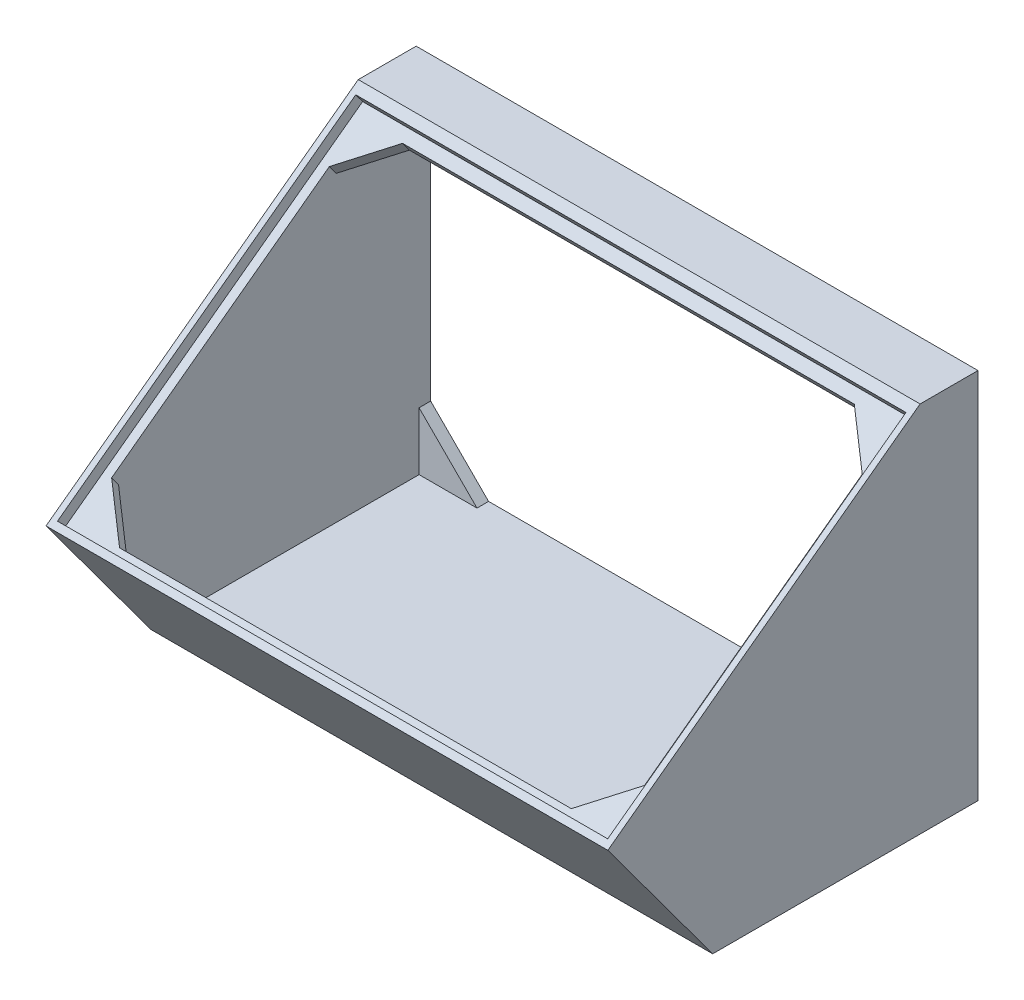
ISO-10303-21;
HEADER;
FILE_DESCRIPTION(('STEP AP214'),'2;1');
FILE_NAME('part.step','',(''),(''),'','','');
FILE_SCHEMA(('AUTOMOTIVE_DESIGN { 1 0 10303 214 1 1 1 1 }'));
ENDSEC;
DATA;
#1=APPLICATION_CONTEXT('core data for automotive mechanical design processes');
#2=APPLICATION_PROTOCOL_DEFINITION('international standard','automotive_design',2000,#1);
#3=PRODUCT_CONTEXT('',#1,'mechanical');
#4=PRODUCT('Part','Part','',(#3));
#5=PRODUCT_RELATED_PRODUCT_CATEGORY('part','',(#4));
#6=PRODUCT_DEFINITION_FORMATION('','',#4);
#7=PRODUCT_DEFINITION_CONTEXT('part definition',#1,'design');
#8=PRODUCT_DEFINITION('design','',#6,#7);
#9=PRODUCT_DEFINITION_SHAPE('','',#8);
#10=(LENGTH_UNIT() NAMED_UNIT(*) SI_UNIT(.MILLI.,.METRE.));
#11=(NAMED_UNIT(*) PLANE_ANGLE_UNIT() SI_UNIT($,.RADIAN.));
#12=(NAMED_UNIT(*) SI_UNIT($,.STERADIAN.) SOLID_ANGLE_UNIT());
#13=UNCERTAINTY_MEASURE_WITH_UNIT(LENGTH_MEASURE(1.E-05),#10,'distance_accuracy_value','');
#14=(GEOMETRIC_REPRESENTATION_CONTEXT(3) GLOBAL_UNCERTAINTY_ASSIGNED_CONTEXT((#13)) GLOBAL_UNIT_ASSIGNED_CONTEXT((#10,
#11,#12)) REPRESENTATION_CONTEXT('',''));
#15=CARTESIAN_POINT('',(0.,0.,0.));
#16=DIRECTION('',(0.,0.,1.));
#17=DIRECTION('',(1.,0.,0.));
#18=AXIS2_PLACEMENT_3D('',#15,#16,#17);
#19=CARTESIAN_POINT('',(97.,38.9166666666667,0.));
#20=DIRECTION('',(0.,-1.,0.));
#21=DIRECTION('',(0.,0.,-1.));
#22=AXIS2_PLACEMENT_3D('',#19,#20,#21);
#23=PLANE('',#22);
#24=DIRECTION('',(0.,0.,-1.));
#25=VECTOR('',#24,1.);
#26=CARTESIAN_POINT('',(12.5,38.9166666666667,2.));
#27=LINE('',#26,#25);
#28=CARTESIAN_POINT('',(12.5,38.9166666666667,2.));
#29=VERTEX_POINT('',#28);
#30=CARTESIAN_POINT('',(12.5,38.9166666666667,0.));
#31=VERTEX_POINT('',#30);
#32=EDGE_CURVE('E436',#29,#31,#27,.T.);
#33=ORIENTED_EDGE('',*,*,#32,.T.);
#34=DIRECTION('',(-1.,0.,0.));
#35=VECTOR('',#34,1.);
#36=CARTESIAN_POINT('',(97.,38.9166666666667,0.));
#37=LINE('',#36,#35);
#38=CARTESIAN_POINT('',(84.5,38.9166666666667,0.));
#39=VERTEX_POINT('',#38);
#40=EDGE_CURVE('E281',#39,#31,#37,.T.);
#41=ORIENTED_EDGE('',*,*,#40,.F.);
#42=DIRECTION('',(0.,0.,-1.));
#43=VECTOR('',#42,1.);
#44=CARTESIAN_POINT('',(84.5,38.9166666666667,2.));
#45=LINE('',#44,#43);
#46=CARTESIAN_POINT('',(84.5,38.9166666666667,2.));
#47=VERTEX_POINT('',#46);
#48=EDGE_CURVE('E463',#47,#39,#45,.T.);
#49=ORIENTED_EDGE('',*,*,#48,.F.);
#50=DIRECTION('',(1.,0.,0.));
#51=VECTOR('',#50,1.);
#52=CARTESIAN_POINT('',(94.5,38.9166666666667,2.));
#53=LINE('',#52,#51);
#54=CARTESIAN_POINT('',(94.5,38.9166666666667,2.));
#55=VERTEX_POINT('',#54);
#56=EDGE_CURVE('E447',#47,#55,#53,.T.);
#57=ORIENTED_EDGE('',*,*,#56,.T.);
#58=DIRECTION('',(0.,0.,1.));
#59=VECTOR('',#58,1.);
#60=CARTESIAN_POINT('',(94.5,38.9166666666667,0.));
#61=LINE('',#60,#59);
#62=CARTESIAN_POINT('',(94.5,38.9166666666667,6.65116187016871));
#63=VERTEX_POINT('',#62);
#64=EDGE_CURVE('E263',#55,#63,#61,.T.);
#65=ORIENTED_EDGE('',*,*,#64,.T.);
#66=DIRECTION('',(1.,0.,0.));
#67=VECTOR('',#66,1.);
#68=CARTESIAN_POINT('',(1.49999999999997,38.9166666666667,6.65116187016871));
#69=LINE('',#68,#67);
#70=CARTESIAN_POINT('',(2.5,38.9166666666667,6.65116187016871));
#71=VERTEX_POINT('',#70);
#72=EDGE_CURVE('E496',#71,#63,#69,.T.);
#73=ORIENTED_EDGE('',*,*,#72,.F.);
#74=DIRECTION('',(0.,0.,1.));
#75=VECTOR('',#74,1.);
#76=CARTESIAN_POINT('',(2.5,38.9166666666667,0.));
#77=LINE('',#76,#75);
#78=CARTESIAN_POINT('',(2.5,38.9166666666667,2.));
#79=VERTEX_POINT('',#78);
#80=EDGE_CURVE('E277',#79,#71,#77,.T.);
#81=ORIENTED_EDGE('',*,*,#80,.F.);
#82=DIRECTION('',(1.,0.,0.));
#83=VECTOR('',#82,1.);
#84=CARTESIAN_POINT('',(12.5,38.9166666666667,2.));
#85=LINE('',#84,#83);
#86=EDGE_CURVE('E426',#79,#29,#85,.T.);
#87=ORIENTED_EDGE('',*,*,#86,.T.);
#88=EDGE_LOOP('',(#33,#41,#49,#57,#65,#73,#81,#87));
#89=FACE_BOUND('',#88,.T.);
#90=ADVANCED_FACE('F39',(#89),#23,.T.);
#91=CARTESIAN_POINT('',(94.5,0.,0.));
#92=DIRECTION('',(1.,0.,0.));
#93=DIRECTION('',(0.,0.,-1.));
#94=AXIS2_PLACEMENT_3D('',#91,#92,#93);
#95=PLANE('',#94);
#96=DIRECTION('',(0.,-0.593752276825451,0.804647894277114));
#97=VECTOR('',#96,1.);
#98=CARTESIAN_POINT('',(94.5,29.9838812525611,22.1252026984624));
#99=LINE('',#98,#97);
#100=CARTESIAN_POINT('',(94.5,33.4060518320674,17.4875070497326));
#101=VERTEX_POINT('',#100);
#102=CARTESIAN_POINT('',(94.5,5.66661496064908,55.0797493672832));
#103=VERTEX_POINT('',#102);
#104=EDGE_CURVE('E62',#101,#103,#99,.T.);
#105=ORIENTED_EDGE('',*,*,#104,.F.);
#106=DIRECTION('',(0.,0.804647894277114,0.593752276825451));
#107=VECTOR('',#106,1.);
#108=CARTESIAN_POINT('',(94.5,31.7967560435132,16.3000024960817));
#109=LINE('',#108,#107);
#110=CARTESIAN_POINT('',(94.5,31.7967560435132,16.3000024960817));
#111=VERTEX_POINT('',#110);
#112=EDGE_CURVE('E560',#111,#101,#109,.T.);
#113=ORIENTED_EDGE('',*,*,#112,.F.);
#114=DIRECTION('',(0.,-0.593752276825452,0.804647894277113));
#115=VECTOR('',#114,1.);
#116=CARTESIAN_POINT('',(94.5,35.9530219812913,10.6674672361419));
#117=LINE('',#116,#115);
#118=EDGE_CURVE('E55',#63,#111,#117,.T.);
#119=ORIENTED_EDGE('',*,*,#118,.F.);
#120=ORIENTED_EDGE('',*,*,#64,.F.);
#121=DIRECTION('',(0.,-1.,0.));
#122=VECTOR('',#121,1.);
#123=CARTESIAN_POINT('',(94.5,28.9166666666667,2.));
#124=LINE('',#123,#122);
#125=CARTESIAN_POINT('',(94.5,28.9166666666667,2.));
#126=VERTEX_POINT('',#125);
#127=EDGE_CURVE('E451',#55,#126,#124,.T.);
#128=ORIENTED_EDGE('',*,*,#127,.T.);
#129=DIRECTION('',(0.,0.,-1.));
#130=VECTOR('',#129,1.);
#131=CARTESIAN_POINT('',(94.5,28.9166666666667,2.));
#132=LINE('',#131,#130);
#133=CARTESIAN_POINT('',(94.5,28.9166666666667,0.));
#134=VERTEX_POINT('',#133);
#135=EDGE_CURVE('E459',#126,#134,#132,.T.);
#136=ORIENTED_EDGE('',*,*,#135,.T.);
#137=DIRECTION('',(0.,1.,0.));
#138=VECTOR('',#137,1.);
#139=CARTESIAN_POINT('',(94.5,-22.9015754372374,0.));
#140=LINE('',#139,#138);
#141=CARTESIAN_POINT('',(94.5,-10.4015754372374,0.));
#142=VERTEX_POINT('',#141);
#143=EDGE_CURVE('E269',#142,#134,#140,.T.);
#144=ORIENTED_EDGE('',*,*,#143,.F.);
#145=DIRECTION('',(0.,0.,-1.));
#146=VECTOR('',#145,1.);
#147=CARTESIAN_POINT('',(94.5,-10.4015754372374,2.));
#148=LINE('',#147,#146);
#149=CARTESIAN_POINT('',(94.5,-10.4015754372374,2.));
#150=VERTEX_POINT('',#149);
#151=EDGE_CURVE('E484',#150,#142,#148,.T.);
#152=ORIENTED_EDGE('',*,*,#151,.F.);
#153=DIRECTION('',(0.,-1.,0.));
#154=VECTOR('',#153,1.);
#155=CARTESIAN_POINT('',(94.5,-20.4015754372374,2.));
#156=LINE('',#155,#154);
#157=CARTESIAN_POINT('',(94.5,-20.4015754372374,2.));
#158=VERTEX_POINT('',#157);
#159=EDGE_CURVE('E470',#150,#158,#156,.T.);
#160=ORIENTED_EDGE('',*,*,#159,.T.);
#161=DIRECTION('',(0.,0.,-1.));
#162=VECTOR('',#161,1.);
#163=CARTESIAN_POINT('',(94.5,-20.4015754372374,45.8055958566569));
#164=LINE('',#163,#162);
#165=CARTESIAN_POINT('',(94.5,-20.4015754372374,44.5434048844817));
#166=VERTEX_POINT('',#165);
#167=EDGE_CURVE('E261',#166,#158,#164,.T.);
#168=ORIENTED_EDGE('',*,*,#167,.F.);
#169=DIRECTION('',(0.,-0.804647894277114,-0.593752276825451));
#170=VECTOR('',#169,1.);
#171=CARTESIAN_POINT('',(94.5,3.11964481142516,61.8997891808738));
#172=LINE('',#171,#170);
#173=CARTESIAN_POINT('',(94.5,-0.0989467656832992,59.5247800735721));
#174=VERTEX_POINT('',#173);
#175=EDGE_CURVE('E251',#174,#166,#172,.T.);
#176=ORIENTED_EDGE('',*,*,#175,.F.);
#177=DIRECTION('',(0.,0.593752276825451,-0.804647894277114));
#178=VECTOR('',#177,1.);
#179=CARTESIAN_POINT('',(94.5,-0.0989467656832992,59.5247800735721));
#180=LINE('',#179,#178);
#181=CARTESIAN_POINT('',(94.5,4.05731917209486,53.8922448136323));
#182=VERTEX_POINT('',#181);
#183=EDGE_CURVE('E238',#174,#182,#180,.T.);
#184=ORIENTED_EDGE('',*,*,#183,.T.);
#185=DIRECTION('',(0.,0.804647894277114,0.593752276825451));
#186=VECTOR('',#185,1.);
#187=CARTESIAN_POINT('',(94.5,4.05731917209486,53.8922448136323));
#188=LINE('',#187,#186);
#189=EDGE_CURVE('E385',#182,#103,#188,.T.);
#190=ORIENTED_EDGE('',*,*,#189,.T.);
#191=EDGE_LOOP('',(#105,#113,#119,#120,#128,#136,#144,#152,#160,#168,#176,#184,#190));
#192=FACE_BOUND('',#191,.T.);
#193=ADVANCED_FACE('F259',(#192),#95,.F.);
#194=CARTESIAN_POINT('',(2.5,0.,0.));
#195=DIRECTION('',(1.,0.,0.));
#196=DIRECTION('',(0.,0.,-1.));
#197=AXIS2_PLACEMENT_3D('',#194,#195,#196);
#198=PLANE('',#197);
#199=DIRECTION('',(0.,0.804647894277114,0.593752276825451));
#200=VECTOR('',#199,1.);
#201=CARTESIAN_POINT('',(2.5,4.05731917209486,53.8922448136322));
#202=LINE('',#201,#200);
#203=CARTESIAN_POINT('',(2.5,4.05731917209487,53.8922448136322));
#204=VERTEX_POINT('',#203);
#205=CARTESIAN_POINT('',(2.5,5.6666149606491,55.0797493672831));
#206=VERTEX_POINT('',#205);
#207=EDGE_CURVE('E352',#204,#206,#202,.T.);
#208=ORIENTED_EDGE('',*,*,#207,.F.);
#209=DIRECTION('',(0.,-0.59375227682545,0.804647894277114));
#210=VECTOR('',#209,1.);
#211=CARTESIAN_POINT('',(2.5,4.05731917209486,53.8922448136322));
#212=LINE('',#211,#210);
#213=CARTESIAN_POINT('',(2.5,-0.0989467656832932,59.5247800735721));
#214=VERTEX_POINT('',#213);
#215=EDGE_CURVE('E379',#204,#214,#212,.T.);
#216=ORIENTED_EDGE('',*,*,#215,.T.);
#217=DIRECTION('',(0.,-0.804647894277114,-0.593752276825451));
#218=VECTOR('',#217,1.);
#219=CARTESIAN_POINT('',(2.5,3.11964481142516,61.8997891808738));
#220=LINE('',#219,#218);
#221=CARTESIAN_POINT('',(2.5,-20.4015754372374,44.5434048844817));
#222=VERTEX_POINT('',#221);
#223=EDGE_CURVE('E273',#214,#222,#220,.T.);
#224=ORIENTED_EDGE('',*,*,#223,.T.);
#225=DIRECTION('',(0.,0.,-1.));
#226=VECTOR('',#225,1.);
#227=CARTESIAN_POINT('',(2.5,-20.4015754372374,45.8055958566569));
#228=LINE('',#227,#226);
#229=CARTESIAN_POINT('',(2.5,-20.4015754372374,2.));
#230=VERTEX_POINT('',#229);
#231=EDGE_CURVE('E276',#222,#230,#228,.T.);
#232=ORIENTED_EDGE('',*,*,#231,.T.);
#233=DIRECTION('',(0.,1.,0.));
#234=VECTOR('',#233,1.);
#235=CARTESIAN_POINT('',(2.5,-20.4015754372374,2.));
#236=LINE('',#235,#234);
#237=CARTESIAN_POINT('',(2.5,-10.4015754372374,2.));
#238=VERTEX_POINT('',#237);
#239=EDGE_CURVE('E408',#230,#238,#236,.T.);
#240=ORIENTED_EDGE('',*,*,#239,.T.);
#241=DIRECTION('',(0.,0.,-1.));
#242=VECTOR('',#241,1.);
#243=CARTESIAN_POINT('',(2.5,-10.4015754372374,2.));
#244=LINE('',#243,#242);
#245=CARTESIAN_POINT('',(2.5,-10.4015754372374,0.));
#246=VERTEX_POINT('',#245);
#247=EDGE_CURVE('E415',#238,#246,#244,.T.);
#248=ORIENTED_EDGE('',*,*,#247,.T.);
#249=DIRECTION('',(0.,1.,0.));
#250=VECTOR('',#249,1.);
#251=CARTESIAN_POINT('',(2.5,-22.9015754372374,0.));
#252=LINE('',#251,#250);
#253=CARTESIAN_POINT('',(2.5,28.9166666666667,0.));
#254=VERTEX_POINT('',#253);
#255=EDGE_CURVE('E294',#246,#254,#252,.T.);
#256=ORIENTED_EDGE('',*,*,#255,.T.);
#257=DIRECTION('',(0.,0.,-1.));
#258=VECTOR('',#257,1.);
#259=CARTESIAN_POINT('',(2.5,28.9166666666667,2.));
#260=LINE('',#259,#258);
#261=CARTESIAN_POINT('',(2.5,28.9166666666667,2.));
#262=VERTEX_POINT('',#261);
#263=EDGE_CURVE('E440',#262,#254,#260,.T.);
#264=ORIENTED_EDGE('',*,*,#263,.F.);
#265=DIRECTION('',(0.,1.,0.));
#266=VECTOR('',#265,1.);
#267=CARTESIAN_POINT('',(2.5,38.9166666666667,2.));
#268=LINE('',#267,#266);
#269=EDGE_CURVE('E433',#262,#79,#268,.T.);
#270=ORIENTED_EDGE('',*,*,#269,.T.);
#271=ORIENTED_EDGE('',*,*,#80,.T.);
#272=DIRECTION('',(0.,-0.593752276825452,0.804647894277113));
#273=VECTOR('',#272,1.);
#274=CARTESIAN_POINT('',(2.5,28.3745854640069,20.9376981448116));
#275=LINE('',#274,#273);
#276=CARTESIAN_POINT('',(2.5,31.7967560435132,16.3000024960817));
#277=VERTEX_POINT('',#276);
#278=EDGE_CURVE('E11',#71,#277,#275,.T.);
#279=ORIENTED_EDGE('',*,*,#278,.T.);
#280=DIRECTION('',(0.,0.804647894277114,0.593752276825451));
#281=VECTOR('',#280,1.);
#282=CARTESIAN_POINT('',(2.5,31.7967560435132,16.3000024960817));
#283=LINE('',#282,#281);
#284=CARTESIAN_POINT('',(2.5,33.4060518320674,17.4875070497326));
#285=VERTEX_POINT('',#284);
#286=EDGE_CURVE('E355',#277,#285,#283,.T.);
#287=ORIENTED_EDGE('',*,*,#286,.T.);
#288=DIRECTION('',(0.,-0.593752276825451,0.804647894277114));
#289=VECTOR('',#288,1.);
#290=CARTESIAN_POINT('',(2.5,29.9838812525611,22.1252026984624));
#291=LINE('',#290,#289);
#292=EDGE_CURVE('E48',#285,#206,#291,.T.);
#293=ORIENTED_EDGE('',*,*,#292,.T.);
#294=EDGE_LOOP('',(#208,#216,#224,#232,#240,#248,#256,#264,#270,#271,#279,#287,#293));
#295=FACE_BOUND('',#294,.T.);
#296=ADVANCED_FACE('F351',(#295),#198,.T.);
#297=CARTESIAN_POINT('',(97.,3.11964481142516,61.8997891808738));
#298=DIRECTION('',(0.,0.593752276825451,-0.804647894277114));
#299=DIRECTION('',(0.,0.804647894277114,0.593752276825451));
#300=AXIS2_PLACEMENT_3D('',#297,#298,#299);
#301=PLANE('',#300);
#302=DIRECTION('',(0.,0.804647894277114,0.593752276825451));
#303=VECTOR('',#302,1.);
#304=CARTESIAN_POINT('',(87.5,-0.0989467656832888,59.524780073572));
#305=LINE('',#304,#303);
#306=CARTESIAN_POINT('',(87.5,-0.0989467656832888,59.524780073572));
#307=VERTEX_POINT('',#306);
#308=CARTESIAN_POINT('',(87.5,1.51034902287094,60.7122846272229));
#309=VERTEX_POINT('',#308);
#310=EDGE_CURVE('E254',#307,#309,#305,.T.);
#311=ORIENTED_EDGE('',*,*,#310,.F.);
#312=DIRECTION('',(1.,0.,0.));
#313=VECTOR('',#312,1.);
#314=CARTESIAN_POINT('',(87.5,-0.0989467656832888,59.524780073572));
#315=LINE('',#314,#313);
#316=EDGE_CURVE('E241',#307,#174,#315,.T.);
#317=ORIENTED_EDGE('',*,*,#316,.T.);
#318=ORIENTED_EDGE('',*,*,#175,.T.);
#319=DIRECTION('',(-1.,0.,0.));
#320=VECTOR('',#319,1.);
#321=CARTESIAN_POINT('',(97.,-20.4015754372374,44.5434048844817));
#322=LINE('',#321,#320);
#323=EDGE_CURVE('E278',#166,#222,#322,.T.);
#324=ORIENTED_EDGE('',*,*,#323,.T.);
#325=ORIENTED_EDGE('',*,*,#223,.F.);
#326=DIRECTION('',(1.,0.,0.));
#327=VECTOR('',#326,1.);
#328=CARTESIAN_POINT('',(2.5,-0.0989467656832888,59.524780073572));
#329=LINE('',#328,#327);
#330=CARTESIAN_POINT('',(9.49999999999999,-0.0989467656832959,59.5247800735721));
#331=VERTEX_POINT('',#330);
#332=EDGE_CURVE('E383',#214,#331,#329,.T.);
#333=ORIENTED_EDGE('',*,*,#332,.T.);
#334=DIRECTION('',(0.,0.804647894277114,0.593752276825451));
#335=VECTOR('',#334,1.);
#336=CARTESIAN_POINT('',(9.49999999999999,-0.0989467656832992,59.5247800735721));
#337=LINE('',#336,#335);
#338=CARTESIAN_POINT('',(9.49999999999999,1.51034902287093,60.7122846272229));
#339=VERTEX_POINT('',#338);
#340=EDGE_CURVE('E370',#331,#339,#337,.T.);
#341=ORIENTED_EDGE('',*,*,#340,.T.);
#342=DIRECTION('',(1.,0.,0.));
#343=VECTOR('',#342,1.);
#344=CARTESIAN_POINT('',(97.,1.51034902287093,60.7122846272229));
#345=LINE('',#344,#343);
#346=EDGE_CURVE('E376',#339,#309,#345,.T.);
#347=ORIENTED_EDGE('',*,*,#346,.T.);
#348=EDGE_LOOP('',(#311,#317,#318,#324,#325,#333,#341,#347));
#349=FACE_BOUND('',#348,.T.);
#350=ADVANCED_FACE('F249',(#349),#301,.T.);
#351=CARTESIAN_POINT('',(97.,-22.9015754372374,0.));
#352=DIRECTION('',(0.,0.,1.));
#353=DIRECTION('',(1.,0.,0.));
#354=AXIS2_PLACEMENT_3D('',#351,#352,#353);
#355=PLANE('',#354);
#356=ORIENTED_EDGE('',*,*,#255,.F.);
#357=DIRECTION('',(0.707106781186548,-0.707106781186548,0.));
#358=VECTOR('',#357,1.);
#359=CARTESIAN_POINT('',(2.5,-10.4015754372374,0.));
#360=LINE('',#359,#358);
#361=CARTESIAN_POINT('',(12.5,-20.4015754372374,0.));
#362=VERTEX_POINT('',#361);
#363=EDGE_CURVE('E402',#246,#362,#360,.T.);
#364=ORIENTED_EDGE('',*,*,#363,.T.);
#365=DIRECTION('',(-1.,0.,0.));
#366=VECTOR('',#365,1.);
#367=CARTESIAN_POINT('',(97.,-20.4015754372374,0.));
#368=LINE('',#367,#366);
#369=CARTESIAN_POINT('',(84.5,-20.4015754372374,0.));
#370=VERTEX_POINT('',#369);
#371=EDGE_CURVE('E267',#370,#362,#368,.T.);
#372=ORIENTED_EDGE('',*,*,#371,.F.);
#373=DIRECTION('',(0.707106781186547,0.707106781186548,0.));
#374=VECTOR('',#373,1.);
#375=CARTESIAN_POINT('',(94.5,-10.4015754372374,0.));
#376=LINE('',#375,#374);
#377=EDGE_CURVE('E466',#370,#142,#376,.T.);
#378=ORIENTED_EDGE('',*,*,#377,.T.);
#379=ORIENTED_EDGE('',*,*,#143,.T.);
#380=DIRECTION('',(-0.707106781186547,0.707106781186548,0.));
#381=VECTOR('',#380,1.);
#382=CARTESIAN_POINT('',(84.5,38.9166666666667,0.));
#383=LINE('',#382,#381);
#384=EDGE_CURVE('E444',#134,#39,#383,.T.);
#385=ORIENTED_EDGE('',*,*,#384,.T.);
#386=ORIENTED_EDGE('',*,*,#40,.T.);
#387=DIRECTION('',(-0.707106781186548,-0.707106781186547,0.));
#388=VECTOR('',#387,1.);
#389=CARTESIAN_POINT('',(2.5,28.9166666666667,0.));
#390=LINE('',#389,#388);
#391=EDGE_CURVE('E423',#31,#254,#390,.T.);
#392=ORIENTED_EDGE('',*,*,#391,.T.);
#393=EDGE_LOOP('',(#356,#364,#372,#378,#379,#385,#386,#392));
#394=FACE_BOUND('',#393,.T.);
#395=DIRECTION('',(0.,1.,0.));
#396=VECTOR('',#395,1.);
#397=CARTESIAN_POINT('',(0.,-22.9015754372374,0.));
#398=LINE('',#397,#396);
#399=CARTESIAN_POINT('',(0.,-22.9015754372374,0.));
#400=VERTEX_POINT('',#399);
#401=CARTESIAN_POINT('',(0.,41.4166666666667,0.));
#402=VERTEX_POINT('',#401);
#403=EDGE_CURVE('E288',#400,#402,#398,.T.);
#404=ORIENTED_EDGE('',*,*,#403,.T.);
#405=DIRECTION('',(-1.,0.,0.));
#406=VECTOR('',#405,1.);
#407=CARTESIAN_POINT('',(97.,41.4166666666667,0.));
#408=LINE('',#407,#406);
#409=CARTESIAN_POINT('',(97.,41.4166666666667,0.));
#410=VERTEX_POINT('',#409);
#411=EDGE_CURVE('E344',#410,#402,#408,.T.);
#412=ORIENTED_EDGE('',*,*,#411,.F.);
#413=DIRECTION('',(0.,1.,0.));
#414=VECTOR('',#413,1.);
#415=CARTESIAN_POINT('',(97.,-22.9015754372374,0.));
#416=LINE('',#415,#414);
#417=CARTESIAN_POINT('',(97.,-22.9015754372374,0.));
#418=VERTEX_POINT('',#417);
#419=EDGE_CURVE('E297',#418,#410,#416,.T.);
#420=ORIENTED_EDGE('',*,*,#419,.F.);
#421=DIRECTION('',(-1.,0.,0.));
#422=VECTOR('',#421,1.);
#423=CARTESIAN_POINT('',(97.,-22.9015754372374,0.));
#424=LINE('',#423,#422);
#425=EDGE_CURVE('E314',#418,#400,#424,.T.);
#426=ORIENTED_EDGE('',*,*,#425,.T.);
#427=EDGE_LOOP('',(#404,#412,#420,#426));
#428=FACE_BOUND('',#427,.T.);
#429=ADVANCED_FACE('F41',(#394,#428),#355,.F.);
#430=CARTESIAN_POINT('',(97.,41.4166666666667,10.));
#431=DIRECTION('',(0.,-0.804647894277114,-0.593752276825451));
#432=DIRECTION('',(0.,0.593752276825451,-0.804647894277114));
#433=AXIS2_PLACEMENT_3D('',#430,#431,#432);
#434=PLANE('',#433);
#435=DIRECTION('',(0.,0.593752276825451,-0.804647894277114));
#436=VECTOR('',#435,1.);
#437=CARTESIAN_POINT('',(96.0001420709959,2.35897239522184,62.9306457886248));
#438=LINE('',#437,#436);
#439=CARTESIAN_POINT('',(96.0001420709959,2.35897239522184,62.9306457886248));
#440=VERTEX_POINT('',#439);
#441=CARTESIAN_POINT('',(96.0001420709959,40.3591181120507,11.4331805548895));
#442=VERTEX_POINT('',#441);
#443=EDGE_CURVE('E523',#440,#442,#438,.T.);
#444=ORIENTED_EDGE('',*,*,#443,.F.);
#445=DIRECTION('',(1.,0.,0.));
#446=VECTOR('',#445,1.);
#447=CARTESIAN_POINT('',(1.00014207099595,2.35897239522184,62.9306457886248));
#448=LINE('',#447,#446);
#449=CARTESIAN_POINT('',(1.00014207099595,2.35897239522184,62.9306457886248));
#450=VERTEX_POINT('',#449);
#451=EDGE_CURVE('E503',#450,#440,#448,.T.);
#452=ORIENTED_EDGE('',*,*,#451,.F.);
#453=DIRECTION('',(0.,0.593752276825451,-0.804647894277114));
#454=VECTOR('',#453,1.);
#455=CARTESIAN_POINT('',(1.00014207099595,2.35897239522184,62.9306457886248));
#456=LINE('',#455,#454);
#457=CARTESIAN_POINT('',(1.00014207099595,40.3591181120507,11.4331805548895));
#458=VERTEX_POINT('',#457);
#459=EDGE_CURVE('E509',#450,#458,#456,.T.);
#460=ORIENTED_EDGE('',*,*,#459,.T.);
#461=DIRECTION('',(1.,0.,0.));
#462=VECTOR('',#461,1.);
#463=CARTESIAN_POINT('',(1.00014207099595,40.3591181120507,11.4331805548895));
#464=LINE('',#463,#462);
#465=EDGE_CURVE('E527',#458,#442,#464,.T.);
#466=ORIENTED_EDGE('',*,*,#465,.T.);
#467=EDGE_LOOP('',(#444,#452,#460,#466));
#468=FACE_BOUND('',#467,.T.);
#469=DIRECTION('',(0.,-0.593752276825451,0.804647894277114));
#470=VECTOR('',#469,1.);
#471=CARTESIAN_POINT('',(0.,41.4166666666667,10.));
#472=LINE('',#471,#470);
#473=CARTESIAN_POINT('',(0.,41.4166666666667,10.));
#474=VERTEX_POINT('',#473);
#475=CARTESIAN_POINT('',(0.,1.63526411936153,63.9114089165666));
#476=VERTEX_POINT('',#475);
#477=EDGE_CURVE('E321',#474,#476,#472,.T.);
#478=ORIENTED_EDGE('',*,*,#477,.T.);
#479=DIRECTION('',(-1.,0.,0.));
#480=VECTOR('',#479,1.);
#481=CARTESIAN_POINT('',(97.,1.63526411936153,63.9114089165666));
#482=LINE('',#481,#480);
#483=CARTESIAN_POINT('',(97.,1.63526411936153,63.9114089165666));
#484=VERTEX_POINT('',#483);
#485=EDGE_CURVE('E336',#484,#476,#482,.T.);
#486=ORIENTED_EDGE('',*,*,#485,.F.);
#487=DIRECTION('',(0.,-0.593752276825451,0.804647894277114));
#488=VECTOR('',#487,1.);
#489=CARTESIAN_POINT('',(97.,41.4166666666667,10.));
#490=LINE('',#489,#488);
#491=CARTESIAN_POINT('',(97.,41.4166666666667,10.));
#492=VERTEX_POINT('',#491);
#493=EDGE_CURVE('E305',#492,#484,#490,.T.);
#494=ORIENTED_EDGE('',*,*,#493,.F.);
#495=DIRECTION('',(-1.,0.,0.));
#496=VECTOR('',#495,1.);
#497=CARTESIAN_POINT('',(97.,41.4166666666667,10.));
#498=LINE('',#497,#496);
#499=EDGE_CURVE('E340',#492,#474,#498,.T.);
#500=ORIENTED_EDGE('',*,*,#499,.T.);
#501=EDGE_LOOP('',(#478,#486,#494,#500));
#502=FACE_BOUND('',#501,.T.);
#503=ADVANCED_FACE('F667',(#468,#502),#434,.F.);
#504=CARTESIAN_POINT('',(97.,41.4166666666667,0.));
#505=DIRECTION('',(0.,-1.,0.));
#506=DIRECTION('',(0.,0.,-1.));
#507=AXIS2_PLACEMENT_3D('',#504,#505,#506);
#508=PLANE('',#507);
#509=DIRECTION('',(0.,0.,1.));
#510=VECTOR('',#509,1.);
#511=CARTESIAN_POINT('',(0.,41.4166666666667,0.));
#512=LINE('',#511,#510);
#513=EDGE_CURVE('E318',#402,#474,#512,.T.);
#514=ORIENTED_EDGE('',*,*,#513,.T.);
#515=ORIENTED_EDGE('',*,*,#499,.F.);
#516=DIRECTION('',(0.,0.,1.));
#517=VECTOR('',#516,1.);
#518=CARTESIAN_POINT('',(97.,41.4166666666667,0.));
#519=LINE('',#518,#517);
#520=EDGE_CURVE('E301',#410,#492,#519,.T.);
#521=ORIENTED_EDGE('',*,*,#520,.F.);
#522=ORIENTED_EDGE('',*,*,#411,.T.);
#523=EDGE_LOOP('',(#514,#515,#521,#522));
#524=FACE_BOUND('',#523,.T.);
#525=ADVANCED_FACE('F665',(#524),#508,.F.);
#526=CARTESIAN_POINT('',(97.,1.63526411936153,63.9114089165666));
#527=DIRECTION('',(0.,0.593752276825451,-0.804647894277114));
#528=DIRECTION('',(0.,0.804647894277114,0.593752276825451));
#529=AXIS2_PLACEMENT_3D('',#526,#527,#528);
#530=PLANE('',#529);
#531=DIRECTION('',(0.,-0.804647894277114,-0.593752276825451));
#532=VECTOR('',#531,1.);
#533=CARTESIAN_POINT('',(0.,1.63526411936153,63.9114089165666));
#534=LINE('',#533,#532);
#535=CARTESIAN_POINT('',(0.,-22.9015754372374,45.8055958566569));
#536=VERTEX_POINT('',#535);
#537=EDGE_CURVE('E324',#476,#536,#534,.T.);
#538=ORIENTED_EDGE('',*,*,#537,.T.);
#539=DIRECTION('',(-1.,0.,0.));
#540=VECTOR('',#539,1.);
#541=CARTESIAN_POINT('',(97.,-22.9015754372374,45.8055958566569));
#542=LINE('',#541,#540);
#543=CARTESIAN_POINT('',(97.,-22.9015754372374,45.8055958566569));
#544=VERTEX_POINT('',#543);
#545=EDGE_CURVE('E332',#544,#536,#542,.T.);
#546=ORIENTED_EDGE('',*,*,#545,.F.);
#547=DIRECTION('',(0.,-0.804647894277114,-0.593752276825451));
#548=VECTOR('',#547,1.);
#549=CARTESIAN_POINT('',(97.,1.63526411936153,63.9114089165666));
#550=LINE('',#549,#548);
#551=EDGE_CURVE('E308',#484,#544,#550,.T.);
#552=ORIENTED_EDGE('',*,*,#551,.F.);
#553=ORIENTED_EDGE('',*,*,#485,.T.);
#554=EDGE_LOOP('',(#538,#546,#552,#553));
#555=FACE_BOUND('',#554,.T.);
#556=ADVANCED_FACE('F661',(#555),#530,.F.);
#557=CARTESIAN_POINT('',(97.,-22.9015754372374,45.8055958566569));
#558=DIRECTION('',(0.,1.,0.));
#559=DIRECTION('',(0.,0.,1.));
#560=AXIS2_PLACEMENT_3D('',#557,#558,#559);
#561=PLANE('',#560);
#562=DIRECTION('',(0.,0.,-1.));
#563=VECTOR('',#562,1.);
#564=CARTESIAN_POINT('',(0.,-22.9015754372374,45.8055958566569));
#565=LINE('',#564,#563);
#566=EDGE_CURVE('E302',#536,#400,#565,.T.);
#567=ORIENTED_EDGE('',*,*,#566,.T.);
#568=ORIENTED_EDGE('',*,*,#425,.F.);
#569=DIRECTION('',(0.,0.,-1.));
#570=VECTOR('',#569,1.);
#571=CARTESIAN_POINT('',(97.,-22.9015754372374,45.8055958566569));
#572=LINE('',#571,#570);
#573=EDGE_CURVE('E311',#544,#418,#572,.T.);
#574=ORIENTED_EDGE('',*,*,#573,.F.);
#575=ORIENTED_EDGE('',*,*,#545,.T.);
#576=EDGE_LOOP('',(#567,#568,#574,#575));
#577=FACE_BOUND('',#576,.T.);
#578=ADVANCED_FACE('F654',(#577),#561,.F.);
#579=CARTESIAN_POINT('',(97.,0.,0.));
#580=DIRECTION('',(1.,0.,0.));
#581=DIRECTION('',(0.,0.,-1.));
#582=AXIS2_PLACEMENT_3D('',#579,#580,#581);
#583=PLANE('',#582);
#584=ORIENTED_EDGE('',*,*,#419,.T.);
#585=ORIENTED_EDGE('',*,*,#520,.T.);
#586=ORIENTED_EDGE('',*,*,#493,.T.);
#587=ORIENTED_EDGE('',*,*,#551,.T.);
#588=ORIENTED_EDGE('',*,*,#573,.T.);
#589=EDGE_LOOP('',(#584,#585,#586,#587,#588));
#590=FACE_BOUND('',#589,.T.);
#591=ADVANCED_FACE('F651',(#590),#583,.T.);
#592=CARTESIAN_POINT('',(0.,0.,0.));
#593=DIRECTION('',(1.,0.,0.));
#594=DIRECTION('',(0.,0.,-1.));
#595=AXIS2_PLACEMENT_3D('',#592,#593,#594);
#596=PLANE('',#595);
#597=ORIENTED_EDGE('',*,*,#403,.F.);
#598=ORIENTED_EDGE('',*,*,#566,.F.);
#599=ORIENTED_EDGE('',*,*,#537,.F.);
#600=ORIENTED_EDGE('',*,*,#477,.F.);
#601=ORIENTED_EDGE('',*,*,#513,.F.);
#602=EDGE_LOOP('',(#597,#598,#599,#600,#601));
#603=FACE_BOUND('',#602,.T.);
#604=ADVANCED_FACE('F647',(#603),#596,.F.);
#605=CARTESIAN_POINT('',(97.,-20.4015754372374,45.8055958566569));
#606=DIRECTION('',(0.,1.,0.));
#607=DIRECTION('',(0.,0.,1.));
#608=AXIS2_PLACEMENT_3D('',#605,#606,#607);
#609=PLANE('',#608);
#610=DIRECTION('',(0.,0.,-1.));
#611=VECTOR('',#610,1.);
#612=CARTESIAN_POINT('',(12.5,-20.4015754372374,2.));
#613=LINE('',#612,#611);
#614=CARTESIAN_POINT('',(12.5,-20.4015754372374,2.));
#615=VERTEX_POINT('',#614);
#616=EDGE_CURVE('E419',#615,#362,#613,.T.);
#617=ORIENTED_EDGE('',*,*,#616,.F.);
#618=DIRECTION('',(-1.,0.,0.));
#619=VECTOR('',#618,1.);
#620=CARTESIAN_POINT('',(12.5,-20.4015754372374,2.));
#621=LINE('',#620,#619);
#622=EDGE_CURVE('E405',#615,#230,#621,.T.);
#623=ORIENTED_EDGE('',*,*,#622,.T.);
#624=ORIENTED_EDGE('',*,*,#231,.F.);
#625=ORIENTED_EDGE('',*,*,#323,.F.);
#626=ORIENTED_EDGE('',*,*,#167,.T.);
#627=DIRECTION('',(-1.,0.,0.));
#628=VECTOR('',#627,1.);
#629=CARTESIAN_POINT('',(84.5,-20.4015754372374,2.));
#630=LINE('',#629,#628);
#631=CARTESIAN_POINT('',(84.5,-20.4015754372374,2.));
#632=VERTEX_POINT('',#631);
#633=EDGE_CURVE('E473',#158,#632,#630,.T.);
#634=ORIENTED_EDGE('',*,*,#633,.T.);
#635=DIRECTION('',(0.,0.,-1.));
#636=VECTOR('',#635,1.);
#637=CARTESIAN_POINT('',(84.5,-20.4015754372374,2.));
#638=LINE('',#637,#636);
#639=EDGE_CURVE('E480',#632,#370,#638,.T.);
#640=ORIENTED_EDGE('',*,*,#639,.T.);
#641=ORIENTED_EDGE('',*,*,#371,.T.);
#642=EDGE_LOOP('',(#617,#623,#624,#625,#626,#634,#640,#641));
#643=FACE_BOUND('',#642,.T.);
#644=ADVANCED_FACE('F592',(#643),#609,.T.);
#645=CARTESIAN_POINT('',(1.00014207099595,38.7498223234964,10.2456760012386));
#646=DIRECTION('',(0.,-0.593752276825451,0.804647894277114));
#647=DIRECTION('',(0.,-0.804647894277114,-0.593752276825451));
#648=AXIS2_PLACEMENT_3D('',#645,#646,#647);
#649=PLANE('',#648);
#650=DIRECTION('',(0.,0.804647894277114,0.593752276825451));
#651=VECTOR('',#650,1.);
#652=CARTESIAN_POINT('',(1.00014207099595,38.7498223234964,10.2456760012386));
#653=LINE('',#652,#651);
#654=CARTESIAN_POINT('',(1.00014207099595,38.7498223234964,10.2456760012386));
#655=VERTEX_POINT('',#654);
#656=EDGE_CURVE('E537',#655,#458,#653,.T.);
#657=ORIENTED_EDGE('',*,*,#656,.F.);
#658=DIRECTION('',(1.,0.,0.));
#659=VECTOR('',#658,1.);
#660=CARTESIAN_POINT('',(1.00014207099595,38.7498223234964,10.2456760012386));
#661=LINE('',#660,#659);
#662=CARTESIAN_POINT('',(96.0001420709959,38.7498223234964,10.2456760012386));
#663=VERTEX_POINT('',#662);
#664=EDGE_CURVE('E513',#655,#663,#661,.T.);
#665=ORIENTED_EDGE('',*,*,#664,.T.);
#666=DIRECTION('',(0.,0.804647894277114,0.593752276825451));
#667=VECTOR('',#666,1.);
#668=CARTESIAN_POINT('',(96.0001420709959,38.7498223234964,10.2456760012386));
#669=LINE('',#668,#667);
#670=EDGE_CURVE('E540',#663,#442,#669,.T.);
#671=ORIENTED_EDGE('',*,*,#670,.T.);
#672=ORIENTED_EDGE('',*,*,#465,.F.);
#673=EDGE_LOOP('',(#657,#665,#671,#672));
#674=FACE_BOUND('',#673,.T.);
#675=ADVANCED_FACE('F646',(#674),#649,.T.);
#676=CARTESIAN_POINT('',(0.,29.9838812525611,22.1252026984624));
#677=DIRECTION('',(0.,0.804647894277114,0.593752276825451));
#678=DIRECTION('',(0.,-0.593752276825451,0.804647894277114));
#679=AXIS2_PLACEMENT_3D('',#676,#677,#678);
#680=PLANE('',#679);
#681=DIRECTION('',(0.707106781186548,-0.419846261288228,0.568971982510823));
#682=VECTOR('',#681,1.);
#683=CARTESIAN_POINT('',(94.5,33.4060518320674,17.4875070497326));
#684=LINE('',#683,#682);
#685=CARTESIAN_POINT('',(87.5,37.5623177698455,11.8549717897928));
#686=VERTEX_POINT('',#685);
#687=EDGE_CURVE('E571',#686,#101,#684,.T.);
#688=ORIENTED_EDGE('',*,*,#687,.T.);
#689=ORIENTED_EDGE('',*,*,#104,.T.);
#690=DIRECTION('',(-0.707106781186548,-0.419846261288228,0.568971982510823));
#691=VECTOR('',#690,1.);
#692=CARTESIAN_POINT('',(94.5,5.66661496064908,55.0797493672832));
#693=LINE('',#692,#691);
#694=EDGE_CURVE('E256',#103,#309,#693,.T.);
#695=ORIENTED_EDGE('',*,*,#694,.T.);
#696=ORIENTED_EDGE('',*,*,#346,.F.);
#697=DIRECTION('',(-0.707106781186547,0.419846261288229,-0.568971982510824));
#698=VECTOR('',#697,1.);
#699=CARTESIAN_POINT('',(9.49999999999999,1.51034902287093,60.7122846272229));
#700=LINE('',#699,#698);
#701=EDGE_CURVE('E365',#339,#206,#700,.T.);
#702=ORIENTED_EDGE('',*,*,#701,.T.);
#703=ORIENTED_EDGE('',*,*,#292,.F.);
#704=DIRECTION('',(0.707106781186547,0.419846261288229,-0.568971982510824));
#705=VECTOR('',#704,1.);
#706=CARTESIAN_POINT('',(2.5,33.4060518320674,17.4875070497326));
#707=LINE('',#706,#705);
#708=CARTESIAN_POINT('',(9.49999999999999,37.5623177698455,11.8549717897928));
#709=VERTEX_POINT('',#708);
#710=EDGE_CURVE('E369',#285,#709,#707,.T.);
#711=ORIENTED_EDGE('',*,*,#710,.T.);
#712=DIRECTION('',(1.,0.,0.));
#713=VECTOR('',#712,1.);
#714=CARTESIAN_POINT('',(1.49999999999997,37.5623177698455,11.8549717897928));
#715=LINE('',#714,#713);
#716=EDGE_CURVE('E499',#709,#686,#715,.T.);
#717=ORIENTED_EDGE('',*,*,#716,.T.);
#718=EDGE_LOOP('',(#688,#689,#695,#696,#702,#703,#711,#717));
#719=FACE_BOUND('',#718,.T.);
#720=ORIENTED_EDGE('',*,*,#664,.F.);
#721=DIRECTION('',(0.,0.593752276825451,-0.804647894277114));
#722=VECTOR('',#721,1.);
#723=CARTESIAN_POINT('',(1.00014207099595,0.749676606667607,61.7431412349739));
#724=LINE('',#723,#722);
#725=CARTESIAN_POINT('',(1.00014207099595,0.749676606667607,61.7431412349739));
#726=VERTEX_POINT('',#725);
#727=EDGE_CURVE('E516',#726,#655,#724,.T.);
#728=ORIENTED_EDGE('',*,*,#727,.F.);
#729=DIRECTION('',(1.,0.,0.));
#730=VECTOR('',#729,1.);
#731=CARTESIAN_POINT('',(1.00014207099595,0.749676606667607,61.7431412349739));
#732=LINE('',#731,#730);
#733=CARTESIAN_POINT('',(96.0001420709959,0.749676606667607,61.7431412349739));
#734=VERTEX_POINT('',#733);
#735=EDGE_CURVE('E504',#726,#734,#732,.T.);
#736=ORIENTED_EDGE('',*,*,#735,.T.);
#737=DIRECTION('',(0.,0.593752276825451,-0.804647894277114));
#738=VECTOR('',#737,1.);
#739=CARTESIAN_POINT('',(96.0001420709959,0.749676606667607,61.7431412349739));
#740=LINE('',#739,#738);
#741=EDGE_CURVE('E508',#734,#663,#740,.T.);
#742=ORIENTED_EDGE('',*,*,#741,.T.);
#743=EDGE_LOOP('',(#720,#728,#736,#742));
#744=FACE_BOUND('',#743,.T.);
#745=ADVANCED_FACE('F373',(#719,#744),#680,.T.);
#746=CARTESIAN_POINT('',(1.00014207099595,0.749676606667607,61.7431412349739));
#747=DIRECTION('',(0.,-0.593752276825451,0.804647894277114));
#748=DIRECTION('',(0.,-0.804647894277114,-0.593752276825451));
#749=AXIS2_PLACEMENT_3D('',#746,#747,#748);
#750=PLANE('',#749);
#751=ORIENTED_EDGE('',*,*,#451,.T.);
#752=DIRECTION('',(0.,0.804647894277114,0.593752276825451));
#753=VECTOR('',#752,1.);
#754=CARTESIAN_POINT('',(96.0001420709959,0.749676606667607,61.7431412349739));
#755=LINE('',#754,#753);
#756=EDGE_CURVE('E520',#734,#440,#755,.T.);
#757=ORIENTED_EDGE('',*,*,#756,.F.);
#758=ORIENTED_EDGE('',*,*,#735,.F.);
#759=DIRECTION('',(0.,0.804647894277114,0.593752276825451));
#760=VECTOR('',#759,1.);
#761=CARTESIAN_POINT('',(1.00014207099595,0.749676606667607,61.7431412349739));
#762=LINE('',#761,#760);
#763=EDGE_CURVE('E534',#726,#450,#762,.T.);
#764=ORIENTED_EDGE('',*,*,#763,.T.);
#765=EDGE_LOOP('',(#751,#757,#758,#764));
#766=FACE_BOUND('',#765,.T.);
#767=ADVANCED_FACE('F641',(#766),#750,.F.);
#768=CARTESIAN_POINT('',(1.00014207099595,0.749676606667607,61.7431412349739));
#769=DIRECTION('',(1.,0.,0.));
#770=DIRECTION('',(0.,0.,-1.));
#771=AXIS2_PLACEMENT_3D('',#768,#769,#770);
#772=PLANE('',#771);
#773=ORIENTED_EDGE('',*,*,#459,.F.);
#774=ORIENTED_EDGE('',*,*,#763,.F.);
#775=ORIENTED_EDGE('',*,*,#727,.T.);
#776=ORIENTED_EDGE('',*,*,#656,.T.);
#777=EDGE_LOOP('',(#773,#774,#775,#776));
#778=FACE_BOUND('',#777,.T.);
#779=ADVANCED_FACE('F712',(#778),#772,.T.);
#780=CARTESIAN_POINT('',(96.0001420709959,0.749676606667607,61.7431412349739));
#781=DIRECTION('',(1.,0.,0.));
#782=DIRECTION('',(0.,0.,-1.));
#783=AXIS2_PLACEMENT_3D('',#780,#781,#782);
#784=PLANE('',#783);
#785=ORIENTED_EDGE('',*,*,#443,.T.);
#786=ORIENTED_EDGE('',*,*,#670,.F.);
#787=ORIENTED_EDGE('',*,*,#741,.F.);
#788=ORIENTED_EDGE('',*,*,#756,.T.);
#789=EDGE_LOOP('',(#785,#786,#787,#788));
#790=FACE_BOUND('',#789,.T.);
#791=ADVANCED_FACE('F723',(#790),#784,.F.);
#792=CARTESIAN_POINT('',(1.49999999999997,37.5623177698455,11.8549717897928));
#793=DIRECTION('',(0.,0.593752276825453,-0.804647894277112));
#794=DIRECTION('',(0.,0.804647894277112,0.593752276825453));
#795=AXIS2_PLACEMENT_3D('',#792,#793,#794);
#796=PLANE('',#795);
#797=DIRECTION('',(1.,0.,0.));
#798=VECTOR('',#797,1.);
#799=CARTESIAN_POINT('',(1.49999999999997,35.9530219812913,10.6674672361419));
#800=LINE('',#799,#798);
#801=CARTESIAN_POINT('',(9.49999999999999,35.9530219812913,10.6674672361419));
#802=VERTEX_POINT('',#801);
#803=CARTESIAN_POINT('',(87.5,35.9530219812913,10.6674672361419));
#804=VERTEX_POINT('',#803);
#805=EDGE_CURVE('E493',#802,#804,#800,.T.);
#806=ORIENTED_EDGE('',*,*,#805,.T.);
#807=DIRECTION('',(0.,0.804647894277114,0.593752276825451));
#808=VECTOR('',#807,1.);
#809=CARTESIAN_POINT('',(87.5,35.9530219812913,10.6674672361419));
#810=LINE('',#809,#808);
#811=EDGE_CURVE('E565',#804,#686,#810,.T.);
#812=ORIENTED_EDGE('',*,*,#811,.T.);
#813=ORIENTED_EDGE('',*,*,#716,.F.);
#814=DIRECTION('',(0.,0.804647894277114,0.593752276825451));
#815=VECTOR('',#814,1.);
#816=CARTESIAN_POINT('',(9.49999999999999,35.9530219812913,10.6674672361419));
#817=LINE('',#816,#815);
#818=EDGE_CURVE('E398',#802,#709,#817,.T.);
#819=ORIENTED_EDGE('',*,*,#818,.F.);
#820=EDGE_LOOP('',(#806,#812,#813,#819));
#821=FACE_BOUND('',#820,.T.);
#822=ADVANCED_FACE('F733',(#821),#796,.F.);
#823=CARTESIAN_POINT('',(1.49999999999997,35.9530219812913,10.6674672361419));
#824=DIRECTION('',(0.,0.804647894277113,0.593752276825452));
#825=DIRECTION('',(0.,-0.593752276825452,0.804647894277113));
#826=AXIS2_PLACEMENT_3D('',#823,#824,#825);
#827=PLANE('',#826);
#828=ORIENTED_EDGE('',*,*,#278,.F.);
#829=ORIENTED_EDGE('',*,*,#72,.T.);
#830=ORIENTED_EDGE('',*,*,#118,.T.);
#831=DIRECTION('',(0.707106781186548,-0.419846261288228,0.568971982510823));
#832=VECTOR('',#831,1.);
#833=CARTESIAN_POINT('',(94.5,31.7967560435132,16.3000024960817));
#834=LINE('',#833,#832);
#835=EDGE_CURVE('E568',#804,#111,#834,.T.);
#836=ORIENTED_EDGE('',*,*,#835,.F.);
#837=ORIENTED_EDGE('',*,*,#805,.F.);
#838=DIRECTION('',(0.707106781186547,0.419846261288229,-0.568971982510824));
#839=VECTOR('',#838,1.);
#840=CARTESIAN_POINT('',(2.5,31.7967560435132,16.3000024960817));
#841=LINE('',#840,#839);
#842=EDGE_CURVE('E392',#277,#802,#841,.T.);
#843=ORIENTED_EDGE('',*,*,#842,.F.);
#844=EDGE_LOOP('',(#828,#829,#830,#836,#837,#843));
#845=FACE_BOUND('',#844,.T.);
#846=ADVANCED_FACE('F557',(#845),#827,.F.);
#847=CARTESIAN_POINT('',(94.5,-10.4015754372374,2.));
#848=DIRECTION('',(-0.707106781186548,0.707106781186547,0.));
#849=DIRECTION('',(-0.707106781186547,-0.707106781186548,0.));
#850=AXIS2_PLACEMENT_3D('',#847,#848,#849);
#851=PLANE('',#850);
#852=ORIENTED_EDGE('',*,*,#377,.F.);
#853=ORIENTED_EDGE('',*,*,#639,.F.);
#854=DIRECTION('',(0.707106781186547,0.707106781186548,0.));
#855=VECTOR('',#854,1.);
#856=CARTESIAN_POINT('',(94.5,-10.4015754372374,2.));
#857=LINE('',#856,#855);
#858=EDGE_CURVE('E476',#632,#150,#857,.T.);
#859=ORIENTED_EDGE('',*,*,#858,.T.);
#860=ORIENTED_EDGE('',*,*,#151,.T.);
#861=EDGE_LOOP('',(#852,#853,#859,#860));
#862=FACE_BOUND('',#861,.T.);
#863=ADVANCED_FACE('F618',(#862),#851,.T.);
#864=CARTESIAN_POINT('',(0.,0.,2.));
#865=DIRECTION('',(0.,0.,-1.));
#866=DIRECTION('',(-1.,0.,0.));
#867=AXIS2_PLACEMENT_3D('',#864,#865,#866);
#868=PLANE('',#867);
#869=ORIENTED_EDGE('',*,*,#159,.F.);
#870=ORIENTED_EDGE('',*,*,#858,.F.);
#871=ORIENTED_EDGE('',*,*,#633,.F.);
#872=EDGE_LOOP('',(#869,#870,#871));
#873=FACE_BOUND('',#872,.T.);
#874=ADVANCED_FACE('F623',(#873),#868,.F.);
#875=CARTESIAN_POINT('',(84.5,38.9166666666667,2.));
#876=DIRECTION('',(-0.707106781186548,-0.707106781186547,0.));
#877=DIRECTION('',(0.707106781186547,-0.707106781186548,0.));
#878=AXIS2_PLACEMENT_3D('',#875,#876,#877);
#879=PLANE('',#878);
#880=ORIENTED_EDGE('',*,*,#384,.F.);
#881=ORIENTED_EDGE('',*,*,#135,.F.);
#882=DIRECTION('',(-0.707106781186547,0.707106781186548,0.));
#883=VECTOR('',#882,1.);
#884=CARTESIAN_POINT('',(84.5,38.9166666666667,2.));
#885=LINE('',#884,#883);
#886=EDGE_CURVE('E455',#126,#47,#885,.T.);
#887=ORIENTED_EDGE('',*,*,#886,.T.);
#888=ORIENTED_EDGE('',*,*,#48,.T.);
#889=EDGE_LOOP('',(#880,#881,#887,#888));
#890=FACE_BOUND('',#889,.T.);
#891=ADVANCED_FACE('F613',(#890),#879,.T.);
#892=CARTESIAN_POINT('',(0.,0.,2.));
#893=DIRECTION('',(0.,0.,-1.));
#894=DIRECTION('',(-1.,0.,0.));
#895=AXIS2_PLACEMENT_3D('',#892,#893,#894);
#896=PLANE('',#895);
#897=ORIENTED_EDGE('',*,*,#56,.F.);
#898=ORIENTED_EDGE('',*,*,#886,.F.);
#899=ORIENTED_EDGE('',*,*,#127,.F.);
#900=EDGE_LOOP('',(#897,#898,#899));
#901=FACE_BOUND('',#900,.T.);
#902=ADVANCED_FACE('F630',(#901),#896,.F.);
#903=CARTESIAN_POINT('',(2.5,28.9166666666667,2.));
#904=DIRECTION('',(0.707106781186547,-0.707106781186548,0.));
#905=DIRECTION('',(0.707106781186548,0.707106781186547,0.));
#906=AXIS2_PLACEMENT_3D('',#903,#904,#905);
#907=PLANE('',#906);
#908=ORIENTED_EDGE('',*,*,#391,.F.);
#909=ORIENTED_EDGE('',*,*,#32,.F.);
#910=DIRECTION('',(-0.707106781186548,-0.707106781186547,0.));
#911=VECTOR('',#910,1.);
#912=CARTESIAN_POINT('',(2.5,28.9166666666667,2.));
#913=LINE('',#912,#911);
#914=EDGE_CURVE('E429',#29,#262,#913,.T.);
#915=ORIENTED_EDGE('',*,*,#914,.T.);
#916=ORIENTED_EDGE('',*,*,#263,.T.);
#917=EDGE_LOOP('',(#908,#909,#915,#916));
#918=FACE_BOUND('',#917,.T.);
#919=ADVANCED_FACE('F608',(#918),#907,.T.);
#920=CARTESIAN_POINT('',(0.,0.,2.));
#921=DIRECTION('',(0.,0.,1.));
#922=DIRECTION('',(1.,0.,0.));
#923=AXIS2_PLACEMENT_3D('',#920,#921,#922);
#924=PLANE('',#923);
#925=ORIENTED_EDGE('',*,*,#86,.F.);
#926=ORIENTED_EDGE('',*,*,#269,.F.);
#927=ORIENTED_EDGE('',*,*,#914,.F.);
#928=EDGE_LOOP('',(#925,#926,#927));
#929=FACE_BOUND('',#928,.T.);
#930=ADVANCED_FACE('F611',(#929),#924,.T.);
#931=CARTESIAN_POINT('',(2.5,-10.4015754372374,2.));
#932=DIRECTION('',(0.707106781186547,0.707106781186547,0.));
#933=DIRECTION('',(-0.707106781186548,0.707106781186548,0.));
#934=AXIS2_PLACEMENT_3D('',#931,#932,#933);
#935=PLANE('',#934);
#936=ORIENTED_EDGE('',*,*,#363,.F.);
#937=ORIENTED_EDGE('',*,*,#247,.F.);
#938=DIRECTION('',(0.707106781186548,-0.707106781186548,0.));
#939=VECTOR('',#938,1.);
#940=CARTESIAN_POINT('',(2.5,-10.4015754372374,2.));
#941=LINE('',#940,#939);
#942=EDGE_CURVE('E411',#238,#615,#941,.T.);
#943=ORIENTED_EDGE('',*,*,#942,.T.);
#944=ORIENTED_EDGE('',*,*,#616,.T.);
#945=EDGE_LOOP('',(#936,#937,#943,#944));
#946=FACE_BOUND('',#945,.T.);
#947=ADVANCED_FACE('F600',(#946),#935,.T.);
#948=CARTESIAN_POINT('',(0.,0.,2.));
#949=DIRECTION('',(0.,0.,-1.));
#950=DIRECTION('',(-1.,0.,0.));
#951=AXIS2_PLACEMENT_3D('',#948,#949,#950);
#952=PLANE('',#951);
#953=ORIENTED_EDGE('',*,*,#622,.F.);
#954=ORIENTED_EDGE('',*,*,#942,.F.);
#955=ORIENTED_EDGE('',*,*,#239,.F.);
#956=EDGE_LOOP('',(#953,#954,#955));
#957=FACE_BOUND('',#956,.T.);
#958=ADVANCED_FACE('F596',(#957),#952,.F.);
#959=CARTESIAN_POINT('',(2.5,31.7967560435132,16.3000024960817));
#960=DIRECTION('',(0.707106781186548,-0.419846261288228,0.568971982510823));
#961=DIRECTION('',(0.626900581225857,0.,-0.77909926277637));
#962=AXIS2_PLACEMENT_3D('',#959,#960,#961);
#963=PLANE('',#962);
#964=ORIENTED_EDGE('',*,*,#710,.F.);
#965=ORIENTED_EDGE('',*,*,#286,.F.);
#966=ORIENTED_EDGE('',*,*,#842,.T.);
#967=ORIENTED_EDGE('',*,*,#818,.T.);
#968=EDGE_LOOP('',(#964,#965,#966,#967));
#969=FACE_BOUND('',#968,.T.);
#970=ADVANCED_FACE('F798',(#969),#963,.T.);
#971=CARTESIAN_POINT('',(9.49999999999999,-0.0989467656832992,59.5247800735721));
#972=DIRECTION('',(0.707106781186548,0.419846261288228,-0.568971982510823));
#973=DIRECTION('',(-0.626900581225856,0.,-0.77909926277637));
#974=AXIS2_PLACEMENT_3D('',#971,#972,#973);
#975=PLANE('',#974);
#976=ORIENTED_EDGE('',*,*,#701,.F.);
#977=ORIENTED_EDGE('',*,*,#340,.F.);
#978=DIRECTION('',(-0.707106781186547,0.419846261288229,-0.568971982510824));
#979=VECTOR('',#978,1.);
#980=CARTESIAN_POINT('',(9.49999999999999,-0.0989467656832992,59.5247800735721));
#981=LINE('',#980,#979);
#982=EDGE_CURVE('E367',#331,#204,#981,.T.);
#983=ORIENTED_EDGE('',*,*,#982,.T.);
#984=ORIENTED_EDGE('',*,*,#207,.T.);
#985=EDGE_LOOP('',(#976,#977,#983,#984));
#986=FACE_BOUND('',#985,.T.);
#987=ADVANCED_FACE('F363',(#986),#975,.T.);
#988=CARTESIAN_POINT('',(0.,28.3745854640069,20.9376981448115));
#989=DIRECTION('',(0.,0.804647894277114,0.59375227682545));
#990=DIRECTION('',(0.,-0.59375227682545,0.804647894277114));
#991=AXIS2_PLACEMENT_3D('',#988,#989,#990);
#992=PLANE('',#991);
#993=ORIENTED_EDGE('',*,*,#215,.F.);
#994=ORIENTED_EDGE('',*,*,#982,.F.);
#995=ORIENTED_EDGE('',*,*,#332,.F.);
#996=EDGE_LOOP('',(#993,#994,#995));
#997=FACE_BOUND('',#996,.T.);
#998=ADVANCED_FACE('F588',(#997),#992,.F.);
#999=CARTESIAN_POINT('',(94.5,4.05731917209486,53.8922448136323));
#1000=DIRECTION('',(-0.707106781186547,0.419846261288229,-0.568971982510824));
#1001=DIRECTION('',(-0.626900581225858,0.,0.779099262776369));
#1002=AXIS2_PLACEMENT_3D('',#999,#1000,#1001);
#1003=PLANE('',#1002);
#1004=ORIENTED_EDGE('',*,*,#694,.F.);
#1005=ORIENTED_EDGE('',*,*,#189,.F.);
#1006=DIRECTION('',(-0.707106781186548,-0.419846261288228,0.568971982510823));
#1007=VECTOR('',#1006,1.);
#1008=CARTESIAN_POINT('',(94.5,4.05731917209486,53.8922448136323));
#1009=LINE('',#1008,#1007);
#1010=EDGE_CURVE('E243',#182,#307,#1009,.T.);
#1011=ORIENTED_EDGE('',*,*,#1010,.T.);
#1012=ORIENTED_EDGE('',*,*,#310,.T.);
#1013=EDGE_LOOP('',(#1004,#1005,#1011,#1012));
#1014=FACE_BOUND('',#1013,.T.);
#1015=ADVANCED_FACE('F820',(#1014),#1003,.T.);
#1016=CARTESIAN_POINT('',(0.,28.374585464007,20.9376981448116));
#1017=DIRECTION('',(0.,0.804647894277114,0.593752276825451));
#1018=DIRECTION('',(0.,-0.593752276825451,0.804647894277113));
#1019=AXIS2_PLACEMENT_3D('',#1016,#1017,#1018);
#1020=PLANE('',#1019);
#1021=ORIENTED_EDGE('',*,*,#316,.F.);
#1022=ORIENTED_EDGE('',*,*,#1010,.F.);
#1023=ORIENTED_EDGE('',*,*,#183,.F.);
#1024=EDGE_LOOP('',(#1021,#1022,#1023));
#1025=FACE_BOUND('',#1024,.T.);
#1026=ADVANCED_FACE('F240',(#1025),#1020,.F.);
#1027=CARTESIAN_POINT('',(94.5,31.7967560435132,16.3000024960817));
#1028=DIRECTION('',(-0.707106781186547,-0.419846261288229,0.568971982510824));
#1029=DIRECTION('',(0.626900581225858,0.,0.779099262776369));
#1030=AXIS2_PLACEMENT_3D('',#1027,#1028,#1029);
#1031=PLANE('',#1030);
#1032=ORIENTED_EDGE('',*,*,#687,.F.);
#1033=ORIENTED_EDGE('',*,*,#811,.F.);
#1034=ORIENTED_EDGE('',*,*,#835,.T.);
#1035=ORIENTED_EDGE('',*,*,#112,.T.);
#1036=EDGE_LOOP('',(#1032,#1033,#1034,#1035));
#1037=FACE_BOUND('',#1036,.T.);
#1038=ADVANCED_FACE('F569',(#1037),#1031,.T.);
#1039=CLOSED_SHELL('',(#90,#193,#296,#350,#429,#503,#525,#556,#578,#591,#604,#644,#675,#745,
#767,#779,#791,#822,#846,#863,#874,#891,#902,#919,#930,#947,#958,#970,#987,#998,#1015,#1026,#1038));
#1040=MANIFOLD_SOLID_BREP('B2',#1039);
#1041=ADVANCED_BREP_SHAPE_REPRESENTATION('',(#18,#1040),#14);
#1042=SHAPE_DEFINITION_REPRESENTATION(#9,#1041);
ENDSEC;
END-ISO-10303-21;
